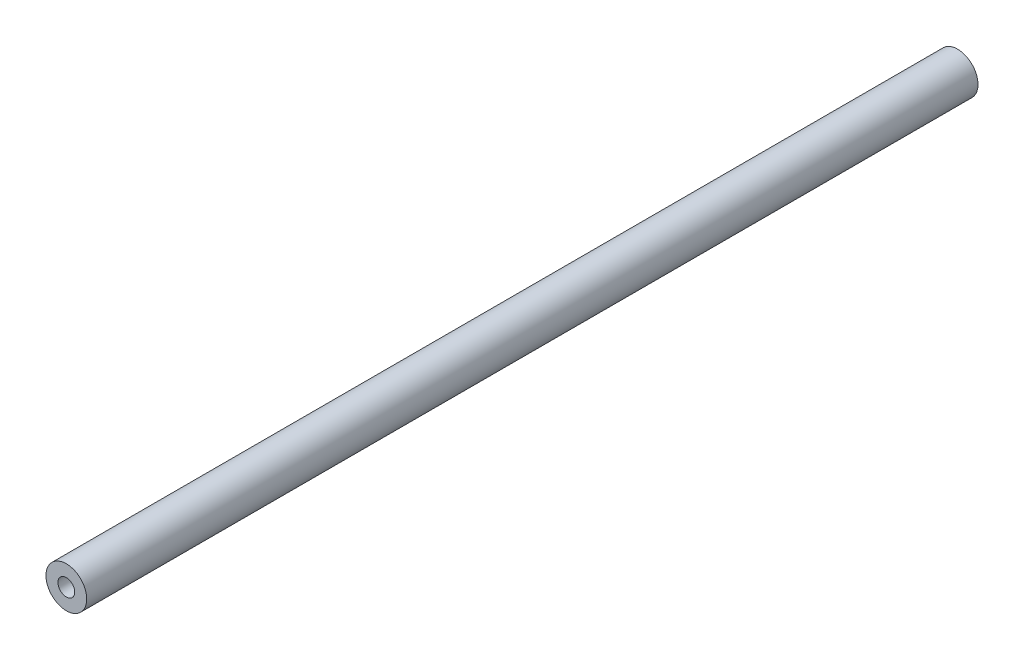
ISO-10303-21;
HEADER;
FILE_DESCRIPTION(('STEP AP214'),'2;1');
FILE_NAME('part.step','',(''),(''),'','','');
FILE_SCHEMA(('AUTOMOTIVE_DESIGN { 1 0 10303 214 1 1 1 1 }'));
ENDSEC;
DATA;
#1=APPLICATION_CONTEXT('core data for automotive mechanical design processes');
#2=APPLICATION_PROTOCOL_DEFINITION('international standard','automotive_design',2000,#1);
#3=PRODUCT_CONTEXT('',#1,'mechanical');
#4=PRODUCT('Part','Part','',(#3));
#5=PRODUCT_RELATED_PRODUCT_CATEGORY('part','',(#4));
#6=PRODUCT_DEFINITION_FORMATION('','',#4);
#7=PRODUCT_DEFINITION_CONTEXT('part definition',#1,'design');
#8=PRODUCT_DEFINITION('design','',#6,#7);
#9=PRODUCT_DEFINITION_SHAPE('','',#8);
#10=(LENGTH_UNIT() NAMED_UNIT(*) SI_UNIT(.MILLI.,.METRE.));
#11=(NAMED_UNIT(*) PLANE_ANGLE_UNIT() SI_UNIT($,.RADIAN.));
#12=(NAMED_UNIT(*) SI_UNIT($,.STERADIAN.) SOLID_ANGLE_UNIT());
#13=UNCERTAINTY_MEASURE_WITH_UNIT(LENGTH_MEASURE(1.E-05),#10,'distance_accuracy_value','');
#14=(GEOMETRIC_REPRESENTATION_CONTEXT(3) GLOBAL_UNCERTAINTY_ASSIGNED_CONTEXT((#13)) GLOBAL_UNIT_ASSIGNED_CONTEXT((#10,
#11,#12)) REPRESENTATION_CONTEXT('',''));
#15=CARTESIAN_POINT('',(0.,0.,0.));
#16=DIRECTION('',(0.,0.,1.));
#17=DIRECTION('',(1.,0.,0.));
#18=AXIS2_PLACEMENT_3D('',#15,#16,#17);
#19=CARTESIAN_POINT('',(0.,0.,87.5));
#20=DIRECTION('',(0.,0.,-1.));
#21=DIRECTION('',(-1.,0.,0.));
#22=AXIS2_PLACEMENT_3D('',#19,#20,#21);
#23=CYLINDRICAL_SURFACE('',#22,4.);
#24=CARTESIAN_POINT('',(0.,0.,87.5));
#25=DIRECTION('',(0.,0.,1.));
#26=DIRECTION('',(1.,0.,0.));
#27=AXIS2_PLACEMENT_3D('',#24,#25,#26);
#28=CIRCLE('',#27,4.);
#29=CARTESIAN_POINT('',(4.,0.,87.5));
#30=VERTEX_POINT('',#29);
#31=EDGE_CURVE('E11',#30,#30,#28,.T.);
#32=ORIENTED_EDGE('',*,*,#31,.F.);
#33=EDGE_LOOP('',(#32));
#34=FACE_BOUND('',#33,.T.);
#35=CARTESIAN_POINT('',(0.,0.,-87.5));
#36=DIRECTION('',(0.,0.,1.));
#37=DIRECTION('',(1.,0.,0.));
#38=AXIS2_PLACEMENT_3D('',#35,#36,#37);
#39=CIRCLE('',#38,4.);
#40=CARTESIAN_POINT('',(4.,0.,-87.5));
#41=VERTEX_POINT('',#40);
#42=EDGE_CURVE('E42',#41,#41,#39,.T.);
#43=ORIENTED_EDGE('',*,*,#42,.T.);
#44=EDGE_LOOP('',(#43));
#45=FACE_BOUND('',#44,.T.);
#46=ADVANCED_FACE('F39',(#34,#45),#23,.T.);
#47=CARTESIAN_POINT('',(0.,0.,87.5));
#48=DIRECTION('',(0.,0.,1.));
#49=DIRECTION('',(1.,0.,0.));
#50=AXIS2_PLACEMENT_3D('',#47,#48,#49);
#51=PLANE('',#50);
#52=CARTESIAN_POINT('',(0.,0.,87.5));
#53=DIRECTION('',(0.,0.,1.));
#54=DIRECTION('',(1.,0.,0.));
#55=AXIS2_PLACEMENT_3D('',#52,#53,#54);
#56=CIRCLE('',#55,1.64999999999999);
#57=CARTESIAN_POINT('',(1.64999999999999,0.,87.5));
#58=VERTEX_POINT('',#57);
#59=EDGE_CURVE('E63',#58,#58,#56,.T.);
#60=ORIENTED_EDGE('',*,*,#59,.F.);
#61=EDGE_LOOP('',(#60));
#62=FACE_BOUND('',#61,.T.);
#63=ORIENTED_EDGE('',*,*,#31,.T.);
#64=EDGE_LOOP('',(#63));
#65=FACE_BOUND('',#64,.T.);
#66=ADVANCED_FACE('F81',(#62,#65),#51,.T.);
#67=CARTESIAN_POINT('',(0.,0.,-87.5));
#68=DIRECTION('',(0.,0.,1.));
#69=DIRECTION('',(1.,0.,0.));
#70=AXIS2_PLACEMENT_3D('',#67,#68,#69);
#71=PLANE('',#70);
#72=CARTESIAN_POINT('',(0.,0.,-87.5));
#73=DIRECTION('',(0.,0.,-1.));
#74=DIRECTION('',(-1.,0.,0.));
#75=AXIS2_PLACEMENT_3D('',#72,#73,#74);
#76=CIRCLE('',#75,1.64999999999999);
#77=CARTESIAN_POINT('',(-1.64999999999999,0.,-87.5));
#78=VERTEX_POINT('',#77);
#79=EDGE_CURVE('E62',#78,#78,#76,.T.);
#80=ORIENTED_EDGE('',*,*,#79,.F.);
#81=EDGE_LOOP('',(#80));
#82=FACE_BOUND('',#81,.T.);
#83=ORIENTED_EDGE('',*,*,#42,.F.);
#84=EDGE_LOOP('',(#83));
#85=FACE_BOUND('',#84,.T.);
#86=ADVANCED_FACE('F78',(#82,#85),#71,.F.);
#87=CARTESIAN_POINT('',(0.,0.,-76.));
#88=DIRECTION('',(0.,0.,-1.));
#89=DIRECTION('',(-1.,0.,0.));
#90=AXIS2_PLACEMENT_3D('',#87,#88,#89);
#91=CONICAL_SURFACE('',#90,1.64999999999999,1.02974425867665);
#92=CARTESIAN_POINT('',(0.,0.,-75.0085799786045));
#93=VERTEX_POINT('',#92);
#94=VERTEX_LOOP('',#93);
#95=FACE_BOUND('',#94,.T.);
#96=CARTESIAN_POINT('',(0.,0.,-76.));
#97=DIRECTION('',(0.,0.,-1.));
#98=DIRECTION('',(-1.,0.,0.));
#99=AXIS2_PLACEMENT_3D('',#96,#97,#98);
#100=CIRCLE('',#99,1.64999999999999);
#101=CARTESIAN_POINT('',(-1.64999999999999,0.,-76.));
#102=VERTEX_POINT('',#101);
#103=EDGE_CURVE('E66',#102,#102,#100,.T.);
#104=ORIENTED_EDGE('',*,*,#103,.T.);
#105=EDGE_LOOP('',(#104));
#106=FACE_BOUND('',#105,.T.);
#107=ADVANCED_FACE('F80',(#95,#106),#91,.F.);
#108=CARTESIAN_POINT('',(0.,0.,-87.5));
#109=DIRECTION('',(0.,0.,-1.));
#110=DIRECTION('',(-1.,0.,0.));
#111=AXIS2_PLACEMENT_3D('',#108,#109,#110);
#112=CYLINDRICAL_SURFACE('',#111,1.64999999999999);
#113=ORIENTED_EDGE('',*,*,#103,.F.);
#114=EDGE_LOOP('',(#113));
#115=FACE_BOUND('',#114,.T.);
#116=ORIENTED_EDGE('',*,*,#79,.T.);
#117=EDGE_LOOP('',(#116));
#118=FACE_BOUND('',#117,.T.);
#119=ADVANCED_FACE('F56',(#115,#118),#112,.F.);
#120=CARTESIAN_POINT('',(0.,0.,76.));
#121=DIRECTION('',(0.,0.,1.));
#122=DIRECTION('',(1.,0.,0.));
#123=AXIS2_PLACEMENT_3D('',#120,#121,#122);
#124=CONICAL_SURFACE('',#123,1.64999999999999,1.02974425867665);
#125=CARTESIAN_POINT('',(0.,0.,75.0085799786045));
#126=VERTEX_POINT('',#125);
#127=VERTEX_LOOP('',#126);
#128=FACE_BOUND('',#127,.T.);
#129=CARTESIAN_POINT('',(0.,0.,76.));
#130=DIRECTION('',(0.,0.,1.));
#131=DIRECTION('',(1.,0.,0.));
#132=AXIS2_PLACEMENT_3D('',#129,#130,#131);
#133=CIRCLE('',#132,1.64999999999999);
#134=CARTESIAN_POINT('',(1.64999999999999,0.,76.));
#135=VERTEX_POINT('',#134);
#136=EDGE_CURVE('E60',#135,#135,#133,.T.);
#137=ORIENTED_EDGE('',*,*,#136,.T.);
#138=EDGE_LOOP('',(#137));
#139=FACE_BOUND('',#138,.T.);
#140=ADVANCED_FACE('F52',(#128,#139),#124,.F.);
#141=CARTESIAN_POINT('',(0.,0.,87.5));
#142=DIRECTION('',(0.,0.,1.));
#143=DIRECTION('',(1.,0.,0.));
#144=AXIS2_PLACEMENT_3D('',#141,#142,#143);
#145=CYLINDRICAL_SURFACE('',#144,1.64999999999999);
#146=ORIENTED_EDGE('',*,*,#136,.F.);
#147=EDGE_LOOP('',(#146));
#148=FACE_BOUND('',#147,.T.);
#149=ORIENTED_EDGE('',*,*,#59,.T.);
#150=EDGE_LOOP('',(#149));
#151=FACE_BOUND('',#150,.T.);
#152=ADVANCED_FACE('F55',(#148,#151),#145,.F.);
#153=CLOSED_SHELL('',(#46,#66,#86,#107,#119,#140,#152));
#154=MANIFOLD_SOLID_BREP('B2',#153);
#155=ADVANCED_BREP_SHAPE_REPRESENTATION('',(#18,#154),#14);
#156=SHAPE_DEFINITION_REPRESENTATION(#9,#155);
ENDSEC;
END-ISO-10303-21;
